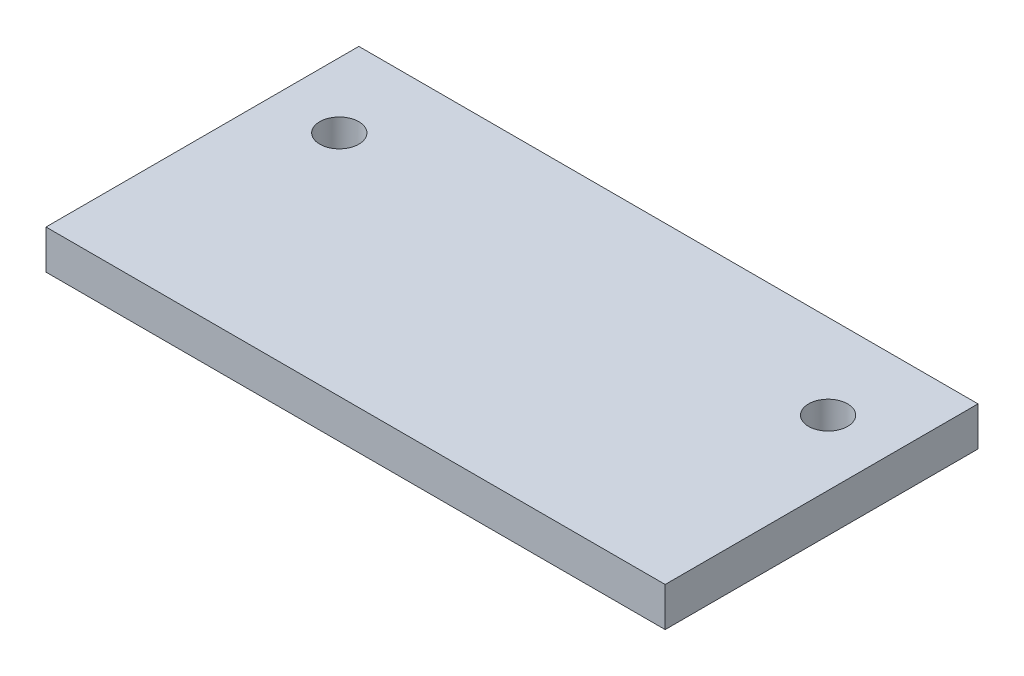
ISO-10303-21;
HEADER;
FILE_DESCRIPTION(('STEP AP214'),'2;1');
FILE_NAME('part.step','',(''),(''),'','','');
FILE_SCHEMA(('AUTOMOTIVE_DESIGN { 1 0 10303 214 1 1 1 1 }'));
ENDSEC;
DATA;
#1=APPLICATION_CONTEXT('core data for automotive mechanical design processes');
#2=APPLICATION_PROTOCOL_DEFINITION('international standard','automotive_design',2000,#1);
#3=PRODUCT_CONTEXT('',#1,'mechanical');
#4=PRODUCT('Part','Part','',(#3));
#5=PRODUCT_RELATED_PRODUCT_CATEGORY('part','',(#4));
#6=PRODUCT_DEFINITION_FORMATION('','',#4);
#7=PRODUCT_DEFINITION_CONTEXT('part definition',#1,'design');
#8=PRODUCT_DEFINITION('design','',#6,#7);
#9=PRODUCT_DEFINITION_SHAPE('','',#8);
#10=(LENGTH_UNIT() NAMED_UNIT(*) SI_UNIT(.MILLI.,.METRE.));
#11=(NAMED_UNIT(*) PLANE_ANGLE_UNIT() SI_UNIT($,.RADIAN.));
#12=(NAMED_UNIT(*) SI_UNIT($,.STERADIAN.) SOLID_ANGLE_UNIT());
#13=UNCERTAINTY_MEASURE_WITH_UNIT(LENGTH_MEASURE(1.E-05),#10,'distance_accuracy_value','');
#14=(GEOMETRIC_REPRESENTATION_CONTEXT(3) GLOBAL_UNCERTAINTY_ASSIGNED_CONTEXT((#13)) GLOBAL_UNIT_ASSIGNED_CONTEXT((#10,
#11,#12)) REPRESENTATION_CONTEXT('',''));
#15=CARTESIAN_POINT('',(0.,0.,0.));
#16=DIRECTION('',(0.,0.,1.));
#17=DIRECTION('',(1.,0.,0.));
#18=AXIS2_PLACEMENT_3D('',#15,#16,#17);
#19=CARTESIAN_POINT('',(0.,3.,0.));
#20=DIRECTION('',(0.,-1.,0.));
#21=DIRECTION('',(0.,0.,-1.));
#22=AXIS2_PLACEMENT_3D('',#19,#20,#21);
#23=PLANE('',#22);
#24=DIRECTION('',(0.,0.,-1.));
#25=VECTOR('',#24,1.);
#26=CARTESIAN_POINT('',(47.5,3.,0.));
#27=LINE('',#26,#25);
#28=CARTESIAN_POINT('',(47.5,3.,0.));
#29=VERTEX_POINT('',#28);
#30=CARTESIAN_POINT('',(47.5,3.,-24.));
#31=VERTEX_POINT('',#30);
#32=EDGE_CURVE('E83',#29,#31,#27,.T.);
#33=ORIENTED_EDGE('',*,*,#32,.T.);
#34=DIRECTION('',(1.,0.,0.));
#35=VECTOR('',#34,1.);
#36=CARTESIAN_POINT('',(0.,3.,-24.));
#37=LINE('',#36,#35);
#38=CARTESIAN_POINT('',(0.,3.,-24.));
#39=VERTEX_POINT('',#38);
#40=EDGE_CURVE('E110',#39,#31,#37,.T.);
#41=ORIENTED_EDGE('',*,*,#40,.F.);
#42=DIRECTION('',(0.,0.,1.));
#43=VECTOR('',#42,1.);
#44=CARTESIAN_POINT('',(0.,3.,0.));
#45=LINE('',#44,#43);
#46=CARTESIAN_POINT('',(0.,3.,0.));
#47=VERTEX_POINT('',#46);
#48=EDGE_CURVE('E87',#39,#47,#45,.T.);
#49=ORIENTED_EDGE('',*,*,#48,.T.);
#50=DIRECTION('',(1.,0.,0.));
#51=VECTOR('',#50,1.);
#52=CARTESIAN_POINT('',(0.,3.,0.));
#53=LINE('',#52,#51);
#54=EDGE_CURVE('E57',#47,#29,#53,.T.);
#55=ORIENTED_EDGE('',*,*,#54,.T.);
#56=EDGE_LOOP('',(#33,#41,#49,#55));
#57=FACE_BOUND('',#56,.T.);
#58=CARTESIAN_POINT('',(42.5,3.,-17.5));
#59=DIRECTION('',(0.,1.,0.));
#60=DIRECTION('',(0.,0.,1.));
#61=AXIS2_PLACEMENT_3D('',#58,#59,#60);
#62=CIRCLE('',#61,1.49999999999999);
#63=CARTESIAN_POINT('',(42.5,3.,-16.));
#64=VERTEX_POINT('',#63);
#65=EDGE_CURVE('E97',#64,#64,#62,.T.);
#66=ORIENTED_EDGE('',*,*,#65,.F.);
#67=EDGE_LOOP('',(#66));
#68=FACE_BOUND('',#67,.T.);
#69=CARTESIAN_POINT('',(4.99999999999999,3.,-17.5));
#70=DIRECTION('',(0.,1.,0.));
#71=DIRECTION('',(0.,0.,1.));
#72=AXIS2_PLACEMENT_3D('',#69,#70,#71);
#73=CIRCLE('',#72,1.5);
#74=CARTESIAN_POINT('',(4.99999999999999,3.,-16.));
#75=VERTEX_POINT('',#74);
#76=EDGE_CURVE('E103',#75,#75,#73,.T.);
#77=ORIENTED_EDGE('',*,*,#76,.F.);
#78=EDGE_LOOP('',(#77));
#79=FACE_BOUND('',#78,.T.);
#80=ADVANCED_FACE('F33',(#57,#68,#79),#23,.F.);
#81=CARTESIAN_POINT('',(0.,3.,0.));
#82=DIRECTION('',(1.,0.,0.));
#83=DIRECTION('',(0.,0.,-1.));
#84=AXIS2_PLACEMENT_3D('',#81,#82,#83);
#85=PLANE('',#84);
#86=ORIENTED_EDGE('',*,*,#48,.F.);
#87=DIRECTION('',(0.,1.,0.));
#88=VECTOR('',#87,1.);
#89=CARTESIAN_POINT('',(0.,-0.00100000000000013,-24.));
#90=LINE('',#89,#88);
#91=CARTESIAN_POINT('',(0.,0.,-24.));
#92=VERTEX_POINT('',#91);
#93=EDGE_CURVE('E107',#92,#39,#90,.T.);
#94=ORIENTED_EDGE('',*,*,#93,.F.);
#95=DIRECTION('',(0.,0.,1.));
#96=VECTOR('',#95,1.);
#97=CARTESIAN_POINT('',(0.,0.,0.));
#98=LINE('',#97,#96);
#99=CARTESIAN_POINT('',(0.,0.,0.));
#100=VERTEX_POINT('',#99);
#101=EDGE_CURVE('E78',#92,#100,#98,.T.);
#102=ORIENTED_EDGE('',*,*,#101,.T.);
#103=DIRECTION('',(0.,-1.,0.));
#104=VECTOR('',#103,1.);
#105=CARTESIAN_POINT('',(0.,3.,0.));
#106=LINE('',#105,#104);
#107=EDGE_CURVE('E11',#47,#100,#106,.T.);
#108=ORIENTED_EDGE('',*,*,#107,.F.);
#109=EDGE_LOOP('',(#86,#94,#102,#108));
#110=FACE_BOUND('',#109,.T.);
#111=ADVANCED_FACE('F35',(#110),#85,.F.);
#112=CARTESIAN_POINT('',(0.,3.,0.));
#113=DIRECTION('',(0.,0.,-1.));
#114=DIRECTION('',(-1.,0.,0.));
#115=AXIS2_PLACEMENT_3D('',#112,#113,#114);
#116=PLANE('',#115);
#117=DIRECTION('',(1.,0.,0.));
#118=VECTOR('',#117,1.);
#119=CARTESIAN_POINT('',(0.,0.,0.));
#120=LINE('',#119,#118);
#121=CARTESIAN_POINT('',(47.5,0.,0.));
#122=VERTEX_POINT('',#121);
#123=EDGE_CURVE('E69',#100,#122,#120,.T.);
#124=ORIENTED_EDGE('',*,*,#123,.T.);
#125=DIRECTION('',(0.,-1.,0.));
#126=VECTOR('',#125,1.);
#127=CARTESIAN_POINT('',(47.5,3.,0.));
#128=LINE('',#127,#126);
#129=EDGE_CURVE('E41',#29,#122,#128,.T.);
#130=ORIENTED_EDGE('',*,*,#129,.F.);
#131=ORIENTED_EDGE('',*,*,#54,.F.);
#132=ORIENTED_EDGE('',*,*,#107,.T.);
#133=EDGE_LOOP('',(#124,#130,#131,#132));
#134=FACE_BOUND('',#133,.T.);
#135=ADVANCED_FACE('F71',(#134),#116,.F.);
#136=CARTESIAN_POINT('',(47.5,3.,0.));
#137=DIRECTION('',(-1.,0.,0.));
#138=DIRECTION('',(0.,0.,1.));
#139=AXIS2_PLACEMENT_3D('',#136,#137,#138);
#140=PLANE('',#139);
#141=DIRECTION('',(0.,0.,-1.));
#142=VECTOR('',#141,1.);
#143=CARTESIAN_POINT('',(47.5,0.,0.));
#144=LINE('',#143,#142);
#145=CARTESIAN_POINT('',(47.5,0.,-24.));
#146=VERTEX_POINT('',#145);
#147=EDGE_CURVE('E77',#122,#146,#144,.T.);
#148=ORIENTED_EDGE('',*,*,#147,.T.);
#149=DIRECTION('',(0.,1.,0.));
#150=VECTOR('',#149,1.);
#151=CARTESIAN_POINT('',(47.5,-0.00100000000000013,-24.));
#152=LINE('',#151,#150);
#153=EDGE_CURVE('E48',#146,#31,#152,.T.);
#154=ORIENTED_EDGE('',*,*,#153,.T.);
#155=ORIENTED_EDGE('',*,*,#32,.F.);
#156=ORIENTED_EDGE('',*,*,#129,.T.);
#157=EDGE_LOOP('',(#148,#154,#155,#156));
#158=FACE_BOUND('',#157,.T.);
#159=ADVANCED_FACE('F82',(#158),#140,.F.);
#160=CARTESIAN_POINT('',(0.,0.,0.));
#161=DIRECTION('',(0.,-1.,0.));
#162=DIRECTION('',(0.,0.,-1.));
#163=AXIS2_PLACEMENT_3D('',#160,#161,#162);
#164=PLANE('',#163);
#165=DIRECTION('',(1.,0.,0.));
#166=VECTOR('',#165,1.);
#167=CARTESIAN_POINT('',(0.,0.,-24.));
#168=LINE('',#167,#166);
#169=EDGE_CURVE('E86',#92,#146,#168,.T.);
#170=ORIENTED_EDGE('',*,*,#169,.T.);
#171=ORIENTED_EDGE('',*,*,#147,.F.);
#172=ORIENTED_EDGE('',*,*,#123,.F.);
#173=ORIENTED_EDGE('',*,*,#101,.F.);
#174=EDGE_LOOP('',(#170,#171,#172,#173));
#175=FACE_BOUND('',#174,.T.);
#176=CARTESIAN_POINT('',(4.99999999999999,0.,-17.5));
#177=DIRECTION('',(0.,-1.,0.));
#178=DIRECTION('',(0.,0.,-1.));
#179=AXIS2_PLACEMENT_3D('',#176,#177,#178);
#180=CIRCLE('',#179,1.5);
#181=CARTESIAN_POINT('',(4.99999999999999,0.,-19.));
#182=VERTEX_POINT('',#181);
#183=EDGE_CURVE('E100',#182,#182,#180,.T.);
#184=ORIENTED_EDGE('',*,*,#183,.F.);
#185=EDGE_LOOP('',(#184));
#186=FACE_BOUND('',#185,.T.);
#187=CARTESIAN_POINT('',(42.5,0.,-17.5));
#188=DIRECTION('',(0.,-1.,0.));
#189=DIRECTION('',(0.,0.,-1.));
#190=AXIS2_PLACEMENT_3D('',#187,#188,#189);
#191=CIRCLE('',#190,1.5);
#192=CARTESIAN_POINT('',(42.5,0.,-19.));
#193=VERTEX_POINT('',#192);
#194=EDGE_CURVE('E92',#193,#193,#191,.T.);
#195=ORIENTED_EDGE('',*,*,#194,.F.);
#196=EDGE_LOOP('',(#195));
#197=FACE_BOUND('',#196,.T.);
#198=ADVANCED_FACE('F84',(#175,#186,#197),#164,.T.);
#199=CARTESIAN_POINT('',(42.5,3.,-17.5));
#200=DIRECTION('',(0.,1.,0.));
#201=DIRECTION('',(0.,0.,1.));
#202=AXIS2_PLACEMENT_3D('',#199,#200,#201);
#203=CYLINDRICAL_SURFACE('',#202,1.5);
#204=ORIENTED_EDGE('',*,*,#65,.T.);
#205=EDGE_LOOP('',(#204));
#206=FACE_BOUND('',#205,.T.);
#207=ORIENTED_EDGE('',*,*,#194,.T.);
#208=EDGE_LOOP('',(#207));
#209=FACE_BOUND('',#208,.T.);
#210=ADVANCED_FACE('F127',(#206,#209),#203,.F.);
#211=CARTESIAN_POINT('',(4.99999999999999,3.,-17.5));
#212=DIRECTION('',(0.,1.,0.));
#213=DIRECTION('',(0.,0.,1.));
#214=AXIS2_PLACEMENT_3D('',#211,#212,#213);
#215=CYLINDRICAL_SURFACE('',#214,1.5);
#216=ORIENTED_EDGE('',*,*,#76,.T.);
#217=EDGE_LOOP('',(#216));
#218=FACE_BOUND('',#217,.T.);
#219=ORIENTED_EDGE('',*,*,#183,.T.);
#220=EDGE_LOOP('',(#219));
#221=FACE_BOUND('',#220,.T.);
#222=ADVANCED_FACE('F124',(#218,#221),#215,.F.);
#223=CARTESIAN_POINT('',(0.,-0.00100000000000013,-24.));
#224=DIRECTION('',(0.,0.,1.));
#225=DIRECTION('',(1.,0.,0.));
#226=AXIS2_PLACEMENT_3D('',#223,#224,#225);
#227=PLANE('',#226);
#228=ORIENTED_EDGE('',*,*,#93,.T.);
#229=ORIENTED_EDGE('',*,*,#40,.T.);
#230=ORIENTED_EDGE('',*,*,#153,.F.);
#231=ORIENTED_EDGE('',*,*,#169,.F.);
#232=EDGE_LOOP('',(#228,#229,#230,#231));
#233=FACE_BOUND('',#232,.T.);
#234=ADVANCED_FACE('F113',(#233),#227,.F.);
#235=CLOSED_SHELL('',(#80,#111,#135,#159,#198,#210,#222,#234));
#236=MANIFOLD_SOLID_BREP('B2',#235);
#237=ADVANCED_BREP_SHAPE_REPRESENTATION('',(#18,#236),#14);
#238=SHAPE_DEFINITION_REPRESENTATION(#9,#237);
ENDSEC;
END-ISO-10303-21;
